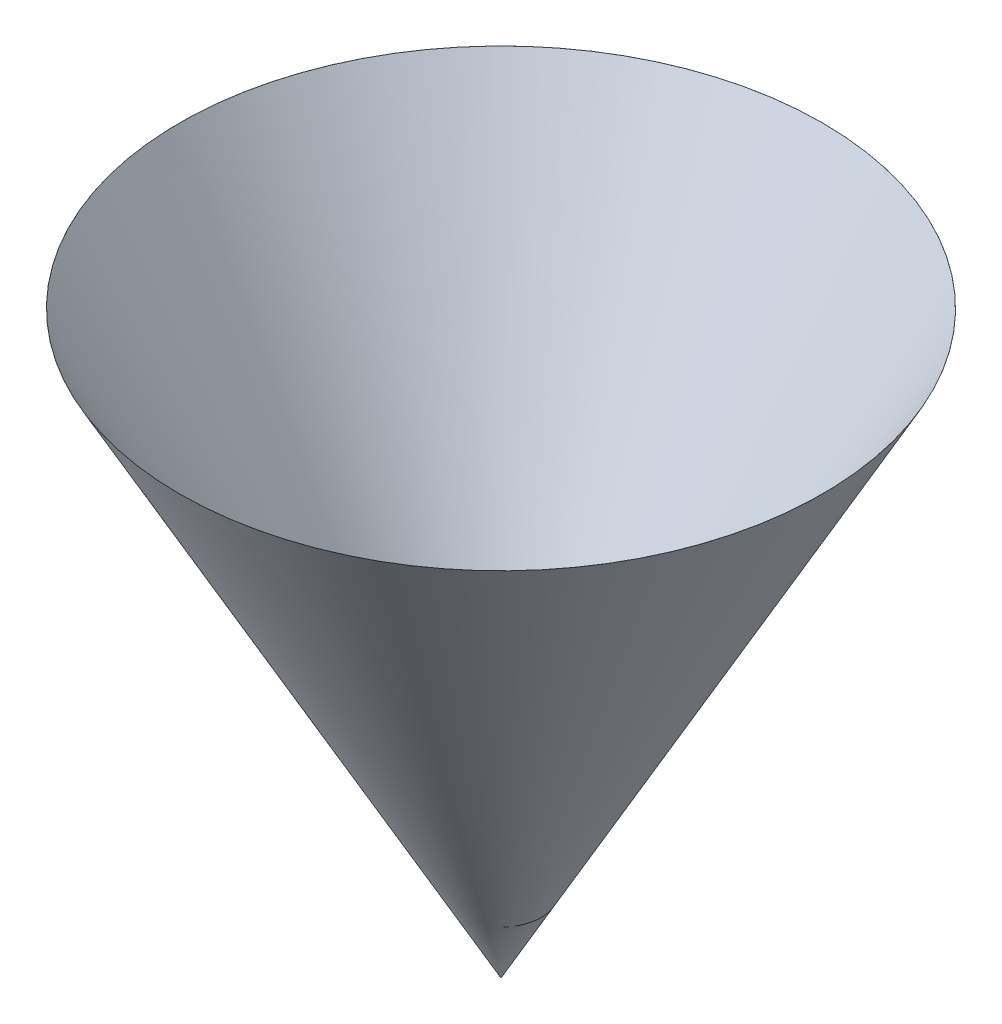
ISO-10303-21;
HEADER;
FILE_DESCRIPTION(('STEP AP214'),'2;1');
FILE_NAME('part.step','',(''),(''),'','','');
FILE_SCHEMA(('AUTOMOTIVE_DESIGN { 1 0 10303 214 1 1 1 1 }'));
ENDSEC;
DATA;
#1=APPLICATION_CONTEXT('core data for automotive mechanical design processes');
#2=APPLICATION_PROTOCOL_DEFINITION('international standard','automotive_design',2000,#1);
#3=PRODUCT_CONTEXT('',#1,'mechanical');
#4=PRODUCT('Part','Part','',(#3));
#5=PRODUCT_RELATED_PRODUCT_CATEGORY('part','',(#4));
#6=PRODUCT_DEFINITION_FORMATION('','',#4);
#7=PRODUCT_DEFINITION_CONTEXT('part definition',#1,'design');
#8=PRODUCT_DEFINITION('design','',#6,#7);
#9=PRODUCT_DEFINITION_SHAPE('','',#8);
#10=(LENGTH_UNIT() NAMED_UNIT(*) SI_UNIT(.MILLI.,.METRE.));
#11=(NAMED_UNIT(*) PLANE_ANGLE_UNIT() SI_UNIT($,.RADIAN.));
#12=(NAMED_UNIT(*) SI_UNIT($,.STERADIAN.) SOLID_ANGLE_UNIT());
#13=UNCERTAINTY_MEASURE_WITH_UNIT(LENGTH_MEASURE(1.E-05),#10,'distance_accuracy_value','');
#14=(GEOMETRIC_REPRESENTATION_CONTEXT(3) GLOBAL_UNCERTAINTY_ASSIGNED_CONTEXT((#13)) GLOBAL_UNIT_ASSIGNED_CONTEXT((#10,
#11,#12)) REPRESENTATION_CONTEXT('',''));
#15=CARTESIAN_POINT('',(0.,0.,0.));
#16=DIRECTION('',(0.,0.,1.));
#17=DIRECTION('',(1.,0.,0.));
#18=AXIS2_PLACEMENT_3D('',#15,#16,#17);
#19=CARTESIAN_POINT('',(0.,150.,0.));
#20=DIRECTION('',(0.,1.,0.));
#21=DIRECTION('',(0.,0.,1.));
#22=AXIS2_PLACEMENT_3D('',#19,#20,#21);
#23=CONICAL_SURFACE('',#22,83.1363577179142,0.50614548307835);
#24=CARTESIAN_POINT('',(0.,0.0180404775527998,0.));
#25=VERTEX_POINT('',#24);
#26=VERTEX_LOOP('',#25);
#27=FACE_BOUND('',#26,.T.);
#28=CARTESIAN_POINT('',(0.,150.,0.));
#29=DIRECTION('',(0.,-1.,0.));
#30=DIRECTION('',(0.,0.,-1.));
#31=AXIS2_PLACEMENT_3D('',#28,#29,#30);
#32=CIRCLE('',#31,83.1363577179142);
#33=CARTESIAN_POINT('',(0.,150.,-83.1363577179142));
#34=VERTEX_POINT('',#33);
#35=EDGE_CURVE('E11',#34,#34,#32,.T.);
#36=ORIENTED_EDGE('',*,*,#35,.F.);
#37=EDGE_LOOP('',(#36));
#38=FACE_BOUND('',#37,.T.);
#39=ADVANCED_FACE('F35',(#27,#38),#23,.F.);
#40=CARTESIAN_POINT('',(0.,150.,-83.1463577179141));
#41=DIRECTION('',(0.,1.,0.));
#42=DIRECTION('',(0.,0.,1.));
#43=AXIS2_PLACEMENT_3D('',#40,#41,#42);
#44=PLANE('',#43);
#45=ORIENTED_EDGE('',*,*,#35,.T.);
#46=EDGE_LOOP('',(#45));
#47=FACE_BOUND('',#46,.T.);
#48=CARTESIAN_POINT('',(0.,150.,0.));
#49=DIRECTION('',(0.,-1.,0.));
#50=DIRECTION('',(0.,0.,-1.));
#51=AXIS2_PLACEMENT_3D('',#48,#49,#50);
#52=CIRCLE('',#51,83.1463577179141);
#53=CARTESIAN_POINT('',(0.,150.,-83.1463577179141));
#54=VERTEX_POINT('',#53);
#55=EDGE_CURVE('E42',#54,#54,#52,.T.);
#56=ORIENTED_EDGE('',*,*,#55,.F.);
#57=EDGE_LOOP('',(#56));
#58=FACE_BOUND('',#57,.T.);
#59=ADVANCED_FACE('F50',(#47,#58),#44,.T.);
#60=CARTESIAN_POINT('',(0.,0.,0.));
#61=DIRECTION('',(0.,1.,0.));
#62=DIRECTION('',(0.,0.,1.));
#63=AXIS2_PLACEMENT_3D('',#60,#61,#62);
#64=CONICAL_SURFACE('',#63,0.,0.50614548307835);
#65=ORIENTED_EDGE('',*,*,#55,.T.);
#66=EDGE_LOOP('',(#65));
#67=FACE_BOUND('',#66,.T.);
#68=CARTESIAN_POINT('',(0.,0.,0.));
#69=VERTEX_POINT('',#68);
#70=VERTEX_LOOP('',#69);
#71=FACE_BOUND('',#70,.T.);
#72=ADVANCED_FACE('F48',(#67,#71),#64,.T.);
#73=CLOSED_SHELL('',(#39,#59,#72));
#74=MANIFOLD_SOLID_BREP('B2',#73);
#75=ADVANCED_BREP_SHAPE_REPRESENTATION('',(#18,#74),#14);
#76=SHAPE_DEFINITION_REPRESENTATION(#9,#75);
ENDSEC;
END-ISO-10303-21;
